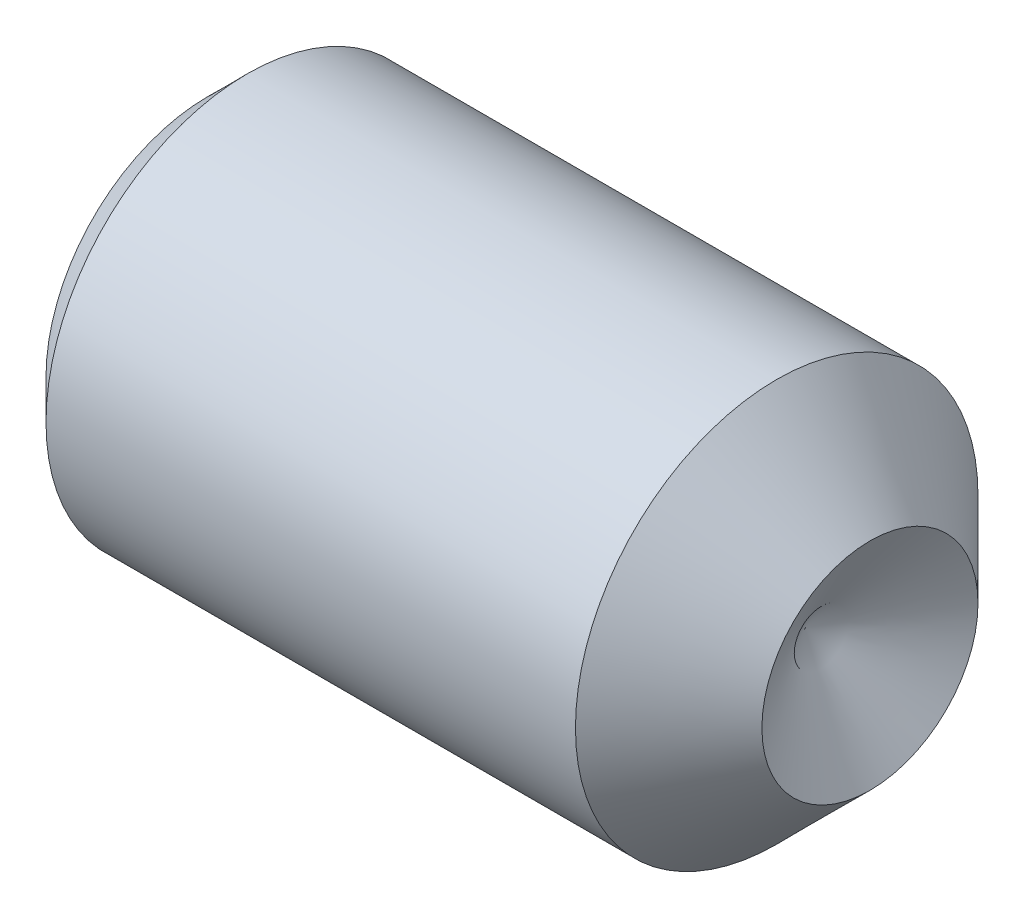
ISO-10303-21;
HEADER;
FILE_DESCRIPTION(('STEP AP214'),'2;1');
FILE_NAME('part.step','',(''),(''),'','','');
FILE_SCHEMA(('AUTOMOTIVE_DESIGN { 1 0 10303 214 1 1 1 1 }'));
ENDSEC;
DATA;
#1=APPLICATION_CONTEXT('core data for automotive mechanical design processes');
#2=APPLICATION_PROTOCOL_DEFINITION('international standard','automotive_design',2000,#1);
#3=PRODUCT_CONTEXT('',#1,'mechanical');
#4=PRODUCT('Part','Part','',(#3));
#5=PRODUCT_RELATED_PRODUCT_CATEGORY('part','',(#4));
#6=PRODUCT_DEFINITION_FORMATION('','',#4);
#7=PRODUCT_DEFINITION_CONTEXT('part definition',#1,'design');
#8=PRODUCT_DEFINITION('design','',#6,#7);
#9=PRODUCT_DEFINITION_SHAPE('','',#8);
#10=(LENGTH_UNIT() NAMED_UNIT(*) SI_UNIT(.MILLI.,.METRE.));
#11=(NAMED_UNIT(*) PLANE_ANGLE_UNIT() SI_UNIT($,.RADIAN.));
#12=(NAMED_UNIT(*) SI_UNIT($,.STERADIAN.) SOLID_ANGLE_UNIT());
#13=UNCERTAINTY_MEASURE_WITH_UNIT(LENGTH_MEASURE(1.E-05),#10,'distance_accuracy_value','');
#14=(GEOMETRIC_REPRESENTATION_CONTEXT(3) GLOBAL_UNCERTAINTY_ASSIGNED_CONTEXT((#13)) GLOBAL_UNIT_ASSIGNED_CONTEXT((#10,
#11,#12)) REPRESENTATION_CONTEXT('',''));
#15=CARTESIAN_POINT('',(0.,0.,0.));
#16=DIRECTION('',(0.,0.,1.));
#17=DIRECTION('',(1.,0.,0.));
#18=AXIS2_PLACEMENT_3D('',#15,#16,#17);
#19=CARTESIAN_POINT('',(0.,0.,0.));
#20=DIRECTION('',(-1.,0.,0.));
#21=DIRECTION('',(0.,0.,1.));
#22=AXIS2_PLACEMENT_3D('',#19,#20,#21);
#23=PLANE('',#22);
#24=CARTESIAN_POINT('',(0.,0.,0.));
#25=DIRECTION('',(-1.,0.,0.));
#26=DIRECTION('',(0.,0.,1.));
#27=AXIS2_PLACEMENT_3D('',#24,#25,#26);
#28=CIRCLE('',#27,1.94056);
#29=CARTESIAN_POINT('',(0.,0.,1.94056));
#30=VERTEX_POINT('',#29);
#31=EDGE_CURVE('E11',#30,#30,#28,.T.);
#32=ORIENTED_EDGE('',*,*,#31,.T.);
#33=EDGE_LOOP('',(#32));
#34=FACE_BOUND('',#33,.T.);
#35=DIRECTION('',(0.,0.,-1.));
#36=VECTOR('',#35,1.);
#37=CARTESIAN_POINT('',(0.,1.18999,0.687041046832963));
#38=LINE('',#37,#36);
#39=CARTESIAN_POINT('',(0.,1.18999,0.687041046832963));
#40=VERTEX_POINT('',#39);
#41=CARTESIAN_POINT('',(0.,1.18999,-0.687041046832962));
#42=VERTEX_POINT('',#41);
#43=EDGE_CURVE('E91',#40,#42,#38,.T.);
#44=ORIENTED_EDGE('',*,*,#43,.F.);
#45=DIRECTION('',(0.,-0.866025403784438,0.5));
#46=VECTOR('',#45,1.);
#47=CARTESIAN_POINT('',(0.,1.18999,0.687041046832963));
#48=LINE('',#47,#46);
#49=CARTESIAN_POINT('',(0.,0.,1.37408209366593));
#50=VERTEX_POINT('',#49);
#51=EDGE_CURVE('E44',#40,#50,#48,.T.);
#52=ORIENTED_EDGE('',*,*,#51,.T.);
#53=DIRECTION('',(0.,0.866025403784439,0.5));
#54=VECTOR('',#53,1.);
#55=CARTESIAN_POINT('',(0.,-1.18999,0.687041046832963));
#56=LINE('',#55,#54);
#57=CARTESIAN_POINT('',(0.,-1.18999,0.687041046832963));
#58=VERTEX_POINT('',#57);
#59=EDGE_CURVE('E97',#58,#50,#56,.T.);
#60=ORIENTED_EDGE('',*,*,#59,.F.);
#61=DIRECTION('',(0.,0.,-1.));
#62=VECTOR('',#61,1.);
#63=CARTESIAN_POINT('',(0.,-1.18999,0.687041046832963));
#64=LINE('',#63,#62);
#65=CARTESIAN_POINT('',(0.,-1.18999,-0.687041046832962));
#66=VERTEX_POINT('',#65);
#67=EDGE_CURVE('E117',#58,#66,#64,.T.);
#68=ORIENTED_EDGE('',*,*,#67,.T.);
#69=DIRECTION('',(0.,0.866025403784438,-0.5));
#70=VECTOR('',#69,1.);
#71=CARTESIAN_POINT('',(0.,-1.18999,-0.687041046832962));
#72=LINE('',#71,#70);
#73=CARTESIAN_POINT('',(0.,0.,-1.37408209366593));
#74=VERTEX_POINT('',#73);
#75=EDGE_CURVE('E120',#66,#74,#72,.T.);
#76=ORIENTED_EDGE('',*,*,#75,.T.);
#77=DIRECTION('',(0.,-0.866025403784438,-0.5));
#78=VECTOR('',#77,1.);
#79=CARTESIAN_POINT('',(0.,1.18999,-0.687041046832962));
#80=LINE('',#79,#78);
#81=EDGE_CURVE('E123',#42,#74,#80,.T.);
#82=ORIENTED_EDGE('',*,*,#81,.F.);
#83=EDGE_LOOP('',(#44,#52,#60,#68,#76,#82));
#84=FACE_BOUND('',#83,.T.);
#85=ADVANCED_FACE('F30',(#34,#84),#23,.T.);
#86=CARTESIAN_POINT('',(0.,0.,0.));
#87=DIRECTION('',(1.,0.,0.));
#88=DIRECTION('',(0.,0.,-1.));
#89=AXIS2_PLACEMENT_3D('',#86,#87,#88);
#90=CONICAL_SURFACE('',#89,1.94056,0.785398163397452);
#91=CARTESIAN_POINT('',(0.472439999999998,0.,0.));
#92=DIRECTION('',(-1.,0.,0.));
#93=DIRECTION('',(0.,0.,1.));
#94=AXIS2_PLACEMENT_3D('',#91,#92,#93);
#95=CIRCLE('',#94,2.413);
#96=CARTESIAN_POINT('',(0.472439999999998,0.,2.413));
#97=VERTEX_POINT('',#96);
#98=EDGE_CURVE('E37',#97,#97,#95,.T.);
#99=ORIENTED_EDGE('',*,*,#98,.T.);
#100=EDGE_LOOP('',(#99));
#101=FACE_BOUND('',#100,.T.);
#102=ORIENTED_EDGE('',*,*,#31,.F.);
#103=EDGE_LOOP('',(#102));
#104=FACE_BOUND('',#103,.T.);
#105=ADVANCED_FACE('F143',(#101,#104),#90,.T.);
#106=CARTESIAN_POINT('',(-12.7,0.,0.));
#107=DIRECTION('',(-1.,0.,0.));
#108=DIRECTION('',(0.,0.,1.));
#109=AXIS2_PLACEMENT_3D('',#106,#107,#108);
#110=CYLINDRICAL_SURFACE('',#109,2.413);
#111=CARTESIAN_POINT('',(6.81990000000001,0.,0.));
#112=DIRECTION('',(-1.,0.,0.));
#113=DIRECTION('',(0.,0.,1.));
#114=AXIS2_PLACEMENT_3D('',#111,#112,#113);
#115=CIRCLE('',#114,2.413);
#116=CARTESIAN_POINT('',(6.81990000000001,0.,2.413));
#117=VERTEX_POINT('',#116);
#118=EDGE_CURVE('E138',#117,#117,#115,.T.);
#119=ORIENTED_EDGE('',*,*,#118,.T.);
#120=EDGE_LOOP('',(#119));
#121=FACE_BOUND('',#120,.T.);
#122=ORIENTED_EDGE('',*,*,#98,.F.);
#123=EDGE_LOOP('',(#122));
#124=FACE_BOUND('',#123,.T.);
#125=ADVANCED_FACE('F146',(#121,#124),#110,.T.);
#126=CARTESIAN_POINT('',(6.81990000000001,0.,0.));
#127=DIRECTION('',(-1.,0.,0.));
#128=DIRECTION('',(0.,0.,1.));
#129=AXIS2_PLACEMENT_3D('',#126,#127,#128);
#130=CONICAL_SURFACE('',#129,2.413,0.785398163397454);
#131=CARTESIAN_POINT('',(7.9375,0.,0.));
#132=DIRECTION('',(-1.,0.,0.));
#133=DIRECTION('',(0.,0.,1.));
#134=AXIS2_PLACEMENT_3D('',#131,#132,#133);
#135=CIRCLE('',#134,1.2954);
#136=CARTESIAN_POINT('',(7.9375,0.,1.2954));
#137=VERTEX_POINT('',#136);
#138=EDGE_CURVE('E98',#137,#137,#135,.T.);
#139=ORIENTED_EDGE('',*,*,#138,.T.);
#140=EDGE_LOOP('',(#139));
#141=FACE_BOUND('',#140,.T.);
#142=ORIENTED_EDGE('',*,*,#118,.F.);
#143=EDGE_LOOP('',(#142));
#144=FACE_BOUND('',#143,.T.);
#145=ADVANCED_FACE('F148',(#141,#144),#130,.T.);
#146=CARTESIAN_POINT('',(7.1591451541117,0.,0.));
#147=DIRECTION('',(1.,0.,0.));
#148=DIRECTION('',(0.,0.,-1.));
#149=AXIS2_PLACEMENT_3D('',#146,#147,#148);
#150=CONICAL_SURFACE('',#149,0.,1.02974425867666);
#151=ORIENTED_EDGE('',*,*,#138,.F.);
#152=EDGE_LOOP('',(#151));
#153=FACE_BOUND('',#152,.T.);
#154=CARTESIAN_POINT('',(7.1591451541117,0.,0.));
#155=VERTEX_POINT('',#154);
#156=VERTEX_LOOP('',#155);
#157=FACE_BOUND('',#156,.T.);
#158=ADVANCED_FACE('F155',(#153,#157),#150,.F.);
#159=CARTESIAN_POINT('',(2.54,1.18999,0.687041046832963));
#160=DIRECTION('',(0.,-0.5,-0.866025403784439));
#161=DIRECTION('',(0.,0.866025403784438,-0.5));
#162=AXIS2_PLACEMENT_3D('',#159,#160,#161);
#163=PLANE('',#162);
#164=ORIENTED_EDGE('',*,*,#51,.F.);
#165=DIRECTION('',(-1.,0.,0.));
#166=VECTOR('',#165,1.);
#167=CARTESIAN_POINT('',(2.54,1.18999,0.687041046832963));
#168=LINE('',#167,#166);
#169=CARTESIAN_POINT('',(2.54,1.18999,0.687041046832963));
#170=VERTEX_POINT('',#169);
#171=EDGE_CURVE('E85',#170,#40,#168,.T.);
#172=ORIENTED_EDGE('',*,*,#171,.F.);
#173=DIRECTION('',(0.,-0.866025403784438,0.5));
#174=VECTOR('',#173,1.);
#175=CARTESIAN_POINT('',(2.54,1.18999,0.687041046832963));
#176=LINE('',#175,#174);
#177=CARTESIAN_POINT('',(2.54,0.,1.37408209366593));
#178=VERTEX_POINT('',#177);
#179=EDGE_CURVE('E80',#170,#178,#176,.T.);
#180=ORIENTED_EDGE('',*,*,#179,.T.);
#181=DIRECTION('',(-1.,0.,0.));
#182=VECTOR('',#181,1.);
#183=CARTESIAN_POINT('',(2.54,0.,1.37408209366593));
#184=LINE('',#183,#182);
#185=EDGE_CURVE('E83',#178,#50,#184,.T.);
#186=ORIENTED_EDGE('',*,*,#185,.T.);
#187=EDGE_LOOP('',(#164,#172,#180,#186));
#188=FACE_BOUND('',#187,.T.);
#189=ADVANCED_FACE('F82',(#188),#163,.T.);
#190=CARTESIAN_POINT('',(2.54,-1.18999,0.687041046832963));
#191=DIRECTION('',(0.,-0.5,0.866025403784439));
#192=DIRECTION('',(0.,-0.866025403784439,-0.5));
#193=AXIS2_PLACEMENT_3D('',#190,#191,#192);
#194=PLANE('',#193);
#195=ORIENTED_EDGE('',*,*,#59,.T.);
#196=ORIENTED_EDGE('',*,*,#185,.F.);
#197=DIRECTION('',(0.,0.866025403784439,0.5));
#198=VECTOR('',#197,1.);
#199=CARTESIAN_POINT('',(2.54,-1.18999,0.687041046832963));
#200=LINE('',#199,#198);
#201=CARTESIAN_POINT('',(2.54,-1.18999,0.687041046832963));
#202=VERTEX_POINT('',#201);
#203=EDGE_CURVE('E90',#202,#178,#200,.T.);
#204=ORIENTED_EDGE('',*,*,#203,.F.);
#205=DIRECTION('',(-1.,0.,0.));
#206=VECTOR('',#205,1.);
#207=CARTESIAN_POINT('',(2.54,-1.18999,0.687041046832963));
#208=LINE('',#207,#206);
#209=EDGE_CURVE('E99',#202,#58,#208,.T.);
#210=ORIENTED_EDGE('',*,*,#209,.T.);
#211=EDGE_LOOP('',(#195,#196,#204,#210));
#212=FACE_BOUND('',#211,.T.);
#213=ADVANCED_FACE('F95',(#212),#194,.F.);
#214=CARTESIAN_POINT('',(2.54,-1.18999,0.687041046832963));
#215=DIRECTION('',(0.,1.,0.));
#216=DIRECTION('',(0.,0.,1.));
#217=AXIS2_PLACEMENT_3D('',#214,#215,#216);
#218=PLANE('',#217);
#219=ORIENTED_EDGE('',*,*,#67,.F.);
#220=ORIENTED_EDGE('',*,*,#209,.F.);
#221=DIRECTION('',(0.,0.,-1.));
#222=VECTOR('',#221,1.);
#223=CARTESIAN_POINT('',(2.54,-1.18999,0.687041046832963));
#224=LINE('',#223,#222);
#225=CARTESIAN_POINT('',(2.54,-1.18999,-0.687041046832962));
#226=VERTEX_POINT('',#225);
#227=EDGE_CURVE('E104',#202,#226,#224,.T.);
#228=ORIENTED_EDGE('',*,*,#227,.T.);
#229=DIRECTION('',(-1.,0.,0.));
#230=VECTOR('',#229,1.);
#231=CARTESIAN_POINT('',(2.54,-1.18999,-0.687041046832962));
#232=LINE('',#231,#230);
#233=EDGE_CURVE('E133',#226,#66,#232,.T.);
#234=ORIENTED_EDGE('',*,*,#233,.T.);
#235=EDGE_LOOP('',(#219,#220,#228,#234));
#236=FACE_BOUND('',#235,.T.);
#237=ADVANCED_FACE('F178',(#236),#218,.T.);
#238=CARTESIAN_POINT('',(2.54,-1.18999,-0.687041046832962));
#239=DIRECTION('',(0.,0.5,0.866025403784439));
#240=DIRECTION('',(0.,-0.866025403784438,0.5));
#241=AXIS2_PLACEMENT_3D('',#238,#239,#240);
#242=PLANE('',#241);
#243=ORIENTED_EDGE('',*,*,#75,.F.);
#244=ORIENTED_EDGE('',*,*,#233,.F.);
#245=DIRECTION('',(0.,0.866025403784438,-0.5));
#246=VECTOR('',#245,1.);
#247=CARTESIAN_POINT('',(2.54,-1.18999,-0.687041046832962));
#248=LINE('',#247,#246);
#249=CARTESIAN_POINT('',(2.54,0.,-1.37408209366593));
#250=VERTEX_POINT('',#249);
#251=EDGE_CURVE('E106',#226,#250,#248,.T.);
#252=ORIENTED_EDGE('',*,*,#251,.T.);
#253=DIRECTION('',(-1.,0.,0.));
#254=VECTOR('',#253,1.);
#255=CARTESIAN_POINT('',(2.54,0.,-1.37408209366593));
#256=LINE('',#255,#254);
#257=EDGE_CURVE('E131',#250,#74,#256,.T.);
#258=ORIENTED_EDGE('',*,*,#257,.T.);
#259=EDGE_LOOP('',(#243,#244,#252,#258));
#260=FACE_BOUND('',#259,.T.);
#261=ADVANCED_FACE('F174',(#260),#242,.T.);
#262=CARTESIAN_POINT('',(2.54,1.18999,-0.687041046832962));
#263=DIRECTION('',(0.,0.5,-0.866025403784438));
#264=DIRECTION('',(0.,0.866025403784438,0.5));
#265=AXIS2_PLACEMENT_3D('',#262,#263,#264);
#266=PLANE('',#265);
#267=ORIENTED_EDGE('',*,*,#81,.T.);
#268=ORIENTED_EDGE('',*,*,#257,.F.);
#269=DIRECTION('',(0.,-0.866025403784438,-0.5));
#270=VECTOR('',#269,1.);
#271=CARTESIAN_POINT('',(2.54,1.18999,-0.687041046832962));
#272=LINE('',#271,#270);
#273=CARTESIAN_POINT('',(2.54,1.18999,-0.687041046832962));
#274=VERTEX_POINT('',#273);
#275=EDGE_CURVE('E110',#274,#250,#272,.T.);
#276=ORIENTED_EDGE('',*,*,#275,.F.);
#277=DIRECTION('',(-1.,0.,0.));
#278=VECTOR('',#277,1.);
#279=CARTESIAN_POINT('',(2.54,1.18999,-0.687041046832962));
#280=LINE('',#279,#278);
#281=EDGE_CURVE('E129',#274,#42,#280,.T.);
#282=ORIENTED_EDGE('',*,*,#281,.T.);
#283=EDGE_LOOP('',(#267,#268,#276,#282));
#284=FACE_BOUND('',#283,.T.);
#285=ADVANCED_FACE('F171',(#284),#266,.F.);
#286=CARTESIAN_POINT('',(2.54,1.18999,0.687041046832963));
#287=DIRECTION('',(0.,1.,0.));
#288=DIRECTION('',(0.,0.,1.));
#289=AXIS2_PLACEMENT_3D('',#286,#287,#288);
#290=PLANE('',#289);
#291=ORIENTED_EDGE('',*,*,#43,.T.);
#292=ORIENTED_EDGE('',*,*,#281,.F.);
#293=DIRECTION('',(0.,0.,-1.));
#294=VECTOR('',#293,1.);
#295=CARTESIAN_POINT('',(2.54,1.18999,0.687041046832963));
#296=LINE('',#295,#294);
#297=EDGE_CURVE('E113',#170,#274,#296,.T.);
#298=ORIENTED_EDGE('',*,*,#297,.F.);
#299=ORIENTED_EDGE('',*,*,#171,.T.);
#300=EDGE_LOOP('',(#291,#292,#298,#299));
#301=FACE_BOUND('',#300,.T.);
#302=ADVANCED_FACE('F167',(#301),#290,.F.);
#303=CARTESIAN_POINT('',(2.54,2.37998,0.));
#304=DIRECTION('',(1.,0.,0.));
#305=DIRECTION('',(0.,0.,-1.));
#306=AXIS2_PLACEMENT_3D('',#303,#304,#305);
#307=PLANE('',#306);
#308=ORIENTED_EDGE('',*,*,#179,.F.);
#309=ORIENTED_EDGE('',*,*,#297,.T.);
#310=ORIENTED_EDGE('',*,*,#275,.T.);
#311=ORIENTED_EDGE('',*,*,#251,.F.);
#312=ORIENTED_EDGE('',*,*,#227,.F.);
#313=ORIENTED_EDGE('',*,*,#203,.T.);
#314=EDGE_LOOP('',(#308,#309,#310,#311,#312,#313));
#315=FACE_BOUND('',#314,.T.);
#316=ADVANCED_FACE('F102',(#315),#307,.F.);
#317=CLOSED_SHELL('',(#85,#105,#125,#145,#158,#189,#213,#237,#261,#285,#302,#316));
#318=MANIFOLD_SOLID_BREP('B2',#317);
#319=ADVANCED_BREP_SHAPE_REPRESENTATION('',(#18,#318),#14);
#320=SHAPE_DEFINITION_REPRESENTATION(#9,#319);
ENDSEC;
END-ISO-10303-21;
